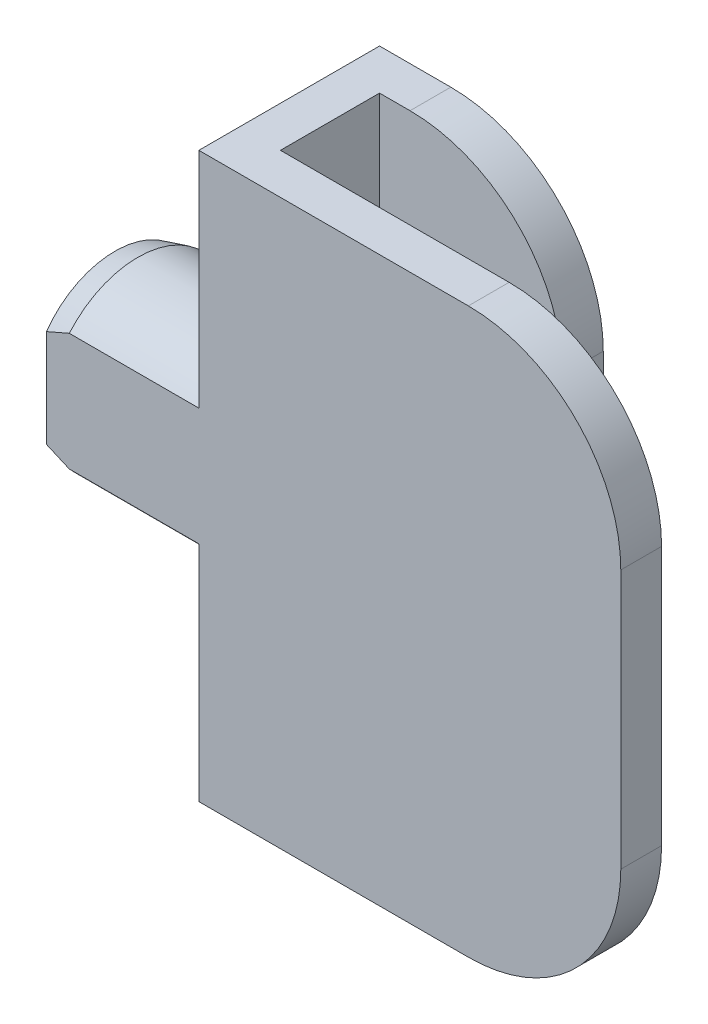
ISO-10303-21;
HEADER;
FILE_DESCRIPTION(('STEP AP214'),'2;1');
FILE_NAME('part.step','',(''),(''),'','','');
FILE_SCHEMA(('AUTOMOTIVE_DESIGN { 1 0 10303 214 1 1 1 1 }'));
ENDSEC;
DATA;
#1=APPLICATION_CONTEXT('core data for automotive mechanical design processes');
#2=APPLICATION_PROTOCOL_DEFINITION('international standard','automotive_design',2000,#1);
#3=PRODUCT_CONTEXT('',#1,'mechanical');
#4=PRODUCT('Part','Part','',(#3));
#5=PRODUCT_RELATED_PRODUCT_CATEGORY('part','',(#4));
#6=PRODUCT_DEFINITION_FORMATION('','',#4);
#7=PRODUCT_DEFINITION_CONTEXT('part definition',#1,'design');
#8=PRODUCT_DEFINITION('design','',#6,#7);
#9=PRODUCT_DEFINITION_SHAPE('','',#8);
#10=(LENGTH_UNIT() NAMED_UNIT(*) SI_UNIT(.MILLI.,.METRE.));
#11=(NAMED_UNIT(*) PLANE_ANGLE_UNIT() SI_UNIT($,.RADIAN.));
#12=(NAMED_UNIT(*) SI_UNIT($,.STERADIAN.) SOLID_ANGLE_UNIT());
#13=UNCERTAINTY_MEASURE_WITH_UNIT(LENGTH_MEASURE(1.E-05),#10,'distance_accuracy_value','');
#14=(GEOMETRIC_REPRESENTATION_CONTEXT(3) GLOBAL_UNCERTAINTY_ASSIGNED_CONTEXT((#13)) GLOBAL_UNIT_ASSIGNED_CONTEXT((#10,
#11,#12)) REPRESENTATION_CONTEXT('',''));
#15=CARTESIAN_POINT('',(0.,0.,0.));
#16=DIRECTION('',(0.,0.,1.));
#17=DIRECTION('',(1.,0.,0.));
#18=AXIS2_PLACEMENT_3D('',#15,#16,#17);
#19=CARTESIAN_POINT('',(0.,-18.5,0.));
#20=DIRECTION('',(0.,1.,0.));
#21=DIRECTION('',(0.,0.,1.));
#22=AXIS2_PLACEMENT_3D('',#19,#20,#21);
#23=PLANE('',#22);
#24=DIRECTION('',(0.,0.,-1.));
#25=VECTOR('',#24,1.);
#26=CARTESIAN_POINT('',(3.49999999999999,-18.5,5.92600000000001));
#27=LINE('',#26,#25);
#28=CARTESIAN_POINT('',(3.49999999999999,-18.5,-5.06746553720356));
#29=VERTEX_POINT('',#28);
#30=CARTESIAN_POINT('',(3.49999999999999,-18.5,-5.92500000000001));
#31=VERTEX_POINT('',#30);
#32=EDGE_CURVE('E276',#29,#31,#27,.T.);
#33=ORIENTED_EDGE('',*,*,#32,.F.);
#34=CARTESIAN_POINT('',(4.0907670429884,-18.5,-15.05));
#35=DIRECTION('',(0.,1.,0.));
#36=DIRECTION('',(0.,0.,1.));
#37=AXIS2_PLACEMENT_3D('',#34,#35,#36);
#38=CIRCLE('',#37,10.);
#39=CARTESIAN_POINT('',(0.,-18.5,-5.92500000000001));
#40=VERTEX_POINT('',#39);
#41=EDGE_CURVE('E204',#29,#40,#38,.F.);
#42=ORIENTED_EDGE('',*,*,#41,.T.);
#43=DIRECTION('',(-1.,0.,0.));
#44=VECTOR('',#43,1.);
#45=CARTESIAN_POINT('',(12.,-18.5,-5.92500000000001));
#46=LINE('',#45,#44);
#47=EDGE_CURVE('E213',#31,#40,#46,.T.);
#48=ORIENTED_EDGE('',*,*,#47,.F.);
#49=EDGE_LOOP('',(#33,#42,#48));
#50=FACE_BOUND('',#49,.T.);
#51=ADVANCED_FACE('F34',(#50),#23,.F.);
#52=CARTESIAN_POINT('',(0.,0.,-5.05));
#53=DIRECTION('',(0.,0.,1.));
#54=DIRECTION('',(1.,0.,0.));
#55=AXIS2_PLACEMENT_3D('',#52,#53,#54);
#56=PLANE('',#55);
#57=DIRECTION('',(1.,0.,0.));
#58=VECTOR('',#57,1.);
#59=CARTESIAN_POINT('',(-2.67500000000001,-20.,-5.05));
#60=LINE('',#59,#58);
#61=CARTESIAN_POINT('',(4.0907670429884,-20.,-5.05));
#62=VERTEX_POINT('',#61);
#63=CARTESIAN_POINT('',(12.,-20.,-5.05));
#64=VERTEX_POINT('',#63);
#65=EDGE_CURVE('E237',#62,#64,#60,.T.);
#66=ORIENTED_EDGE('',*,*,#65,.F.);
#67=DIRECTION('',(0.,1.,0.));
#68=VECTOR('',#67,1.);
#69=CARTESIAN_POINT('',(4.0907670429884,0.,-5.05));
#70=LINE('',#69,#68);
#71=CARTESIAN_POINT('',(4.0907670429884,-18.5,-5.05));
#72=VERTEX_POINT('',#71);
#73=EDGE_CURVE('E199',#62,#72,#70,.T.);
#74=ORIENTED_EDGE('',*,*,#73,.T.);
#75=DIRECTION('',(-1.,0.,0.));
#76=VECTOR('',#75,1.);
#77=CARTESIAN_POINT('',(-2.67500000000001,-18.5,-5.05));
#78=LINE('',#77,#76);
#79=CARTESIAN_POINT('',(12.,-18.5,-5.05));
#80=VERTEX_POINT('',#79);
#81=EDGE_CURVE('E243',#80,#72,#78,.T.);
#82=ORIENTED_EDGE('',*,*,#81,.F.);
#83=DIRECTION('',(0.,1.,0.));
#84=VECTOR('',#83,1.);
#85=CARTESIAN_POINT('',(12.,-18.5,-5.05));
#86=LINE('',#85,#84);
#87=EDGE_CURVE('E239',#64,#80,#86,.T.);
#88=ORIENTED_EDGE('',*,*,#87,.F.);
#89=EDGE_LOOP('',(#66,#74,#82,#88));
#90=FACE_BOUND('',#89,.T.);
#91=ADVANCED_FACE('F379',(#90),#56,.F.);
#92=DIRECTION('',(-1.,0.,0.));
#93=VECTOR('',#92,1.);
#94=CARTESIAN_POINT('',(0.,-18.5,3.25));
#95=LINE('',#94,#93);
#96=CARTESIAN_POINT('',(15.,-18.5,3.25));
#97=VERTEX_POINT('',#96);
#98=CARTESIAN_POINT('',(0.,-18.5,3.25));
#99=VERTEX_POINT('',#98);
#100=EDGE_CURVE('E313',#97,#99,#95,.T.);
#101=ORIENTED_EDGE('',*,*,#100,.F.);
#102=DIRECTION('',(0.,0.,-1.));
#103=VECTOR('',#102,1.);
#104=CARTESIAN_POINT('',(15.,-18.5,0.));
#105=LINE('',#104,#103);
#106=CARTESIAN_POINT('',(15.,-18.5,5.925));
#107=VERTEX_POINT('',#106);
#108=EDGE_CURVE('E432',#97,#107,#105,.F.);
#109=ORIENTED_EDGE('',*,*,#108,.T.);
#110=DIRECTION('',(1.,0.,0.));
#111=VECTOR('',#110,1.);
#112=CARTESIAN_POINT('',(-2.675,-18.5,5.92500000000001));
#113=LINE('',#112,#111);
#114=CARTESIAN_POINT('',(-2.675,-18.5,5.92500000000001));
#115=VERTEX_POINT('',#114);
#116=EDGE_CURVE('E310',#115,#107,#113,.T.);
#117=ORIENTED_EDGE('',*,*,#116,.F.);
#118=DIRECTION('',(0.,0.,1.));
#119=VECTOR('',#118,1.);
#120=CARTESIAN_POINT('',(-2.67500000000001,-18.5,-5.92500000000001));
#121=LINE('',#120,#119);
#122=CARTESIAN_POINT('',(-2.67500000000001,-18.5,-1.75));
#123=VERTEX_POINT('',#122);
#124=EDGE_CURVE('E308',#123,#115,#121,.T.);
#125=ORIENTED_EDGE('',*,*,#124,.F.);
#126=DIRECTION('',(-1.,0.,0.));
#127=VECTOR('',#126,1.);
#128=CARTESIAN_POINT('',(0.,-18.5,-1.75));
#129=LINE('',#128,#127);
#130=CARTESIAN_POINT('',(0.,-18.5,-1.75));
#131=VERTEX_POINT('',#130);
#132=EDGE_CURVE('E467',#123,#131,#129,.F.);
#133=ORIENTED_EDGE('',*,*,#132,.T.);
#134=DIRECTION('',(0.,0.,-1.));
#135=VECTOR('',#134,1.);
#136=CARTESIAN_POINT('',(0.,-18.5,-3.25));
#137=LINE('',#136,#135);
#138=EDGE_CURVE('E294',#99,#131,#137,.T.);
#139=ORIENTED_EDGE('',*,*,#138,.F.);
#140=EDGE_LOOP('',(#101,#109,#117,#125,#133,#139));
#141=FACE_BOUND('',#140,.T.);
#142=ADVANCED_FACE('F375',(#141),#23,.F.);
#143=CARTESIAN_POINT('',(12.,18.5,-3.25));
#144=DIRECTION('',(-1.,0.,0.));
#145=DIRECTION('',(0.,0.,1.));
#146=AXIS2_PLACEMENT_3D('',#143,#144,#145);
#147=PLANE('',#146);
#148=DIRECTION('',(0.,-1.,0.));
#149=VECTOR('',#148,1.);
#150=CARTESIAN_POINT('',(12.,18.5,-5.92500000000001));
#151=LINE('',#150,#149);
#152=CARTESIAN_POINT('',(12.,8.5,-5.92500000000001));
#153=VERTEX_POINT('',#152);
#154=CARTESIAN_POINT('',(12.,-17.35,-5.92500000000001));
#155=VERTEX_POINT('',#154);
#156=EDGE_CURVE('E335',#153,#155,#151,.T.);
#157=ORIENTED_EDGE('',*,*,#156,.F.);
#158=DIRECTION('',(0.,0.,-1.));
#159=VECTOR('',#158,1.);
#160=CARTESIAN_POINT('',(12.,8.5,-3.25));
#161=LINE('',#160,#159);
#162=CARTESIAN_POINT('',(12.,8.5,-3.25));
#163=VERTEX_POINT('',#162);
#164=EDGE_CURVE('E42',#153,#163,#161,.F.);
#165=ORIENTED_EDGE('',*,*,#164,.T.);
#166=DIRECTION('',(0.,-1.,0.));
#167=VECTOR('',#166,1.);
#168=CARTESIAN_POINT('',(12.,18.5,-3.25));
#169=LINE('',#168,#167);
#170=CARTESIAN_POINT('',(12.,-17.35,-3.25));
#171=VERTEX_POINT('',#170);
#172=EDGE_CURVE('E306',#163,#171,#169,.T.);
#173=ORIENTED_EDGE('',*,*,#172,.T.);
#174=DIRECTION('',(0.,0.,-1.));
#175=VECTOR('',#174,1.);
#176=CARTESIAN_POINT('',(12.,-17.35,5.92600000000001));
#177=LINE('',#176,#175);
#178=EDGE_CURVE('E273',#171,#155,#177,.T.);
#179=ORIENTED_EDGE('',*,*,#178,.T.);
#180=EDGE_LOOP('',(#157,#165,#173,#179));
#181=FACE_BOUND('',#180,.T.);
#182=ADVANCED_FACE('F373',(#181),#147,.F.);
#183=CARTESIAN_POINT('',(12.,18.5,-5.92500000000001));
#184=DIRECTION('',(0.,0.,1.));
#185=DIRECTION('',(1.,0.,0.));
#186=AXIS2_PLACEMENT_3D('',#183,#184,#185);
#187=PLANE('',#186);
#188=DIRECTION('',(-1.,0.,0.));
#189=VECTOR('',#188,1.);
#190=CARTESIAN_POINT('',(12.,18.5,-5.92500000000001));
#191=LINE('',#190,#189);
#192=CARTESIAN_POINT('',(2.,18.5,-5.92500000000001));
#193=VERTEX_POINT('',#192);
#194=CARTESIAN_POINT('',(-2.67500000000001,18.5,-5.92500000000001));
#195=VERTEX_POINT('',#194);
#196=EDGE_CURVE('E291',#193,#195,#191,.T.);
#197=ORIENTED_EDGE('',*,*,#196,.F.);
#198=CARTESIAN_POINT('',(2.,8.5,-5.92500000000001));
#199=DIRECTION('',(0.,0.,1.));
#200=DIRECTION('',(1.,0.,0.));
#201=AXIS2_PLACEMENT_3D('',#198,#199,#200);
#202=CIRCLE('',#201,10.);
#203=EDGE_CURVE('E56',#193,#153,#202,.F.);
#204=ORIENTED_EDGE('',*,*,#203,.T.);
#205=ORIENTED_EDGE('',*,*,#156,.T.);
#206=DIRECTION('',(1.,0.,0.));
#207=VECTOR('',#206,1.);
#208=CARTESIAN_POINT('',(0.,-17.35,-5.92500000000001));
#209=LINE('',#208,#207);
#210=CARTESIAN_POINT('',(3.49999999999999,-17.35,-5.92500000000001));
#211=VERTEX_POINT('',#210);
#212=EDGE_CURVE('E266',#211,#155,#209,.T.);
#213=ORIENTED_EDGE('',*,*,#212,.F.);
#214=DIRECTION('',(0.,1.,0.));
#215=VECTOR('',#214,1.);
#216=CARTESIAN_POINT('',(3.5,0.,-5.92500000000001));
#217=LINE('',#216,#215);
#218=EDGE_CURVE('E264',#31,#211,#217,.T.);
#219=ORIENTED_EDGE('',*,*,#218,.F.);
#220=ORIENTED_EDGE('',*,*,#47,.T.);
#221=DIRECTION('',(0.,1.,0.));
#222=VECTOR('',#221,1.);
#223=CARTESIAN_POINT('',(0.,-20.,-5.92500000000001));
#224=LINE('',#223,#222);
#225=CARTESIAN_POINT('',(0.,-20.,-5.92500000000001));
#226=VERTEX_POINT('',#225);
#227=EDGE_CURVE('E198',#226,#40,#224,.T.);
#228=ORIENTED_EDGE('',*,*,#227,.F.);
#229=DIRECTION('',(1.,0.,0.));
#230=VECTOR('',#229,1.);
#231=CARTESIAN_POINT('',(-2.67500000000001,-20.,-5.92500000000001));
#232=LINE('',#231,#230);
#233=CARTESIAN_POINT('',(-2.67500000000001,-20.,-5.92500000000001));
#234=VERTEX_POINT('',#233);
#235=EDGE_CURVE('E210',#234,#226,#232,.T.);
#236=ORIENTED_EDGE('',*,*,#235,.F.);
#237=DIRECTION('',(0.,-1.,0.));
#238=VECTOR('',#237,1.);
#239=CARTESIAN_POINT('',(-2.67500000000001,18.5,-5.92500000000001));
#240=LINE('',#239,#238);
#241=EDGE_CURVE('E333',#195,#234,#240,.T.);
#242=ORIENTED_EDGE('',*,*,#241,.F.);
#243=EDGE_LOOP('',(#197,#204,#205,#213,#219,#220,#228,#236,#242));
#244=FACE_BOUND('',#243,.T.);
#245=ADVANCED_FACE('F208',(#244),#187,.F.);
#246=CARTESIAN_POINT('',(-2.67500000000001,18.5,-5.92500000000001));
#247=DIRECTION('',(1.,0.,0.));
#248=DIRECTION('',(0.,0.,-1.));
#249=AXIS2_PLACEMENT_3D('',#246,#247,#248);
#250=PLANE('',#249);
#251=CARTESIAN_POINT('',(-2.675,0.,1.425));
#252=DIRECTION('',(-1.,0.,0.));
#253=DIRECTION('',(0.,0.,1.));
#254=AXIS2_PLACEMENT_3D('',#251,#252,#253);
#255=CIRCLE('',#254,5.925);
#256=CARTESIAN_POINT('',(-2.675,3.85429954725888,5.92500000000001));
#257=VERTEX_POINT('',#256);
#258=CARTESIAN_POINT('',(-2.675,-3.85429954725888,5.92500000000001));
#259=VERTEX_POINT('',#258);
#260=EDGE_CURVE('E288',#257,#259,#255,.T.);
#261=ORIENTED_EDGE('',*,*,#260,.F.);
#262=DIRECTION('',(0.,-1.,0.));
#263=VECTOR('',#262,1.);
#264=CARTESIAN_POINT('',(-2.675,18.5,5.92500000000001));
#265=LINE('',#264,#263);
#266=CARTESIAN_POINT('',(-2.675,18.5,5.92500000000001));
#267=VERTEX_POINT('',#266);
#268=EDGE_CURVE('E330',#267,#257,#265,.T.);
#269=ORIENTED_EDGE('',*,*,#268,.F.);
#270=DIRECTION('',(0.,0.,1.));
#271=VECTOR('',#270,1.);
#272=CARTESIAN_POINT('',(-2.67500000000001,18.5,-5.92500000000001));
#273=LINE('',#272,#271);
#274=EDGE_CURVE('E293',#195,#267,#273,.T.);
#275=ORIENTED_EDGE('',*,*,#274,.F.);
#276=ORIENTED_EDGE('',*,*,#241,.T.);
#277=DIRECTION('',(0.,0.,1.));
#278=VECTOR('',#277,1.);
#279=CARTESIAN_POINT('',(-2.67500000000001,-20.,-5.05));
#280=LINE('',#279,#278);
#281=CARTESIAN_POINT('',(-2.67500000000001,-20.,-3.25));
#282=VERTEX_POINT('',#281);
#283=EDGE_CURVE('E220',#234,#282,#280,.T.);
#284=ORIENTED_EDGE('',*,*,#283,.T.);
#285=CARTESIAN_POINT('',(-2.67500000000001,-20.,-1.75));
#286=DIRECTION('',(1.,0.,0.));
#287=DIRECTION('',(0.,0.,-1.));
#288=AXIS2_PLACEMENT_3D('',#285,#286,#287);
#289=CIRCLE('',#288,1.5);
#290=EDGE_CURVE('E465',#282,#123,#289,.T.);
#291=ORIENTED_EDGE('',*,*,#290,.T.);
#292=ORIENTED_EDGE('',*,*,#124,.T.);
#293=EDGE_CURVE('E329',#259,#115,#265,.T.);
#294=ORIENTED_EDGE('',*,*,#293,.F.);
#295=EDGE_LOOP('',(#261,#269,#275,#276,#284,#291,#292,#294));
#296=FACE_BOUND('',#295,.T.);
#297=ADVANCED_FACE('F365',(#296),#250,.F.);
#298=CARTESIAN_POINT('',(-2.675,18.5,5.92500000000001));
#299=DIRECTION('',(0.,0.,-1.));
#300=DIRECTION('',(-1.,0.,0.));
#301=AXIS2_PLACEMENT_3D('',#298,#299,#300);
#302=PLANE('',#301);
#303=ORIENTED_EDGE('',*,*,#116,.T.);
#304=CARTESIAN_POINT('',(15.,-8.5,5.925));
#305=DIRECTION('',(0.,0.,-1.));
#306=DIRECTION('',(-1.,0.,0.));
#307=AXIS2_PLACEMENT_3D('',#304,#305,#306);
#308=CIRCLE('',#307,10.);
#309=CARTESIAN_POINT('',(25.,-8.5,5.925));
#310=VERTEX_POINT('',#309);
#311=EDGE_CURVE('E435',#107,#310,#308,.F.);
#312=ORIENTED_EDGE('',*,*,#311,.T.);
#313=DIRECTION('',(0.,-1.,0.));
#314=VECTOR('',#313,1.);
#315=CARTESIAN_POINT('',(25.,18.5,5.925));
#316=LINE('',#315,#314);
#317=CARTESIAN_POINT('',(25.,8.5,5.925));
#318=VERTEX_POINT('',#317);
#319=EDGE_CURVE('E326',#318,#310,#316,.T.);
#320=ORIENTED_EDGE('',*,*,#319,.F.);
#321=CARTESIAN_POINT('',(15.,8.5,5.925));
#322=DIRECTION('',(0.,0.,-1.));
#323=DIRECTION('',(-1.,0.,0.));
#324=AXIS2_PLACEMENT_3D('',#321,#322,#323);
#325=CIRCLE('',#324,10.);
#326=CARTESIAN_POINT('',(15.,18.5,5.925));
#327=VERTEX_POINT('',#326);
#328=EDGE_CURVE('E424',#318,#327,#325,.F.);
#329=ORIENTED_EDGE('',*,*,#328,.T.);
#330=DIRECTION('',(1.,0.,0.));
#331=VECTOR('',#330,1.);
#332=CARTESIAN_POINT('',(-2.675,18.5,5.92500000000001));
#333=LINE('',#332,#331);
#334=EDGE_CURVE('E296',#267,#327,#333,.T.);
#335=ORIENTED_EDGE('',*,*,#334,.F.);
#336=ORIENTED_EDGE('',*,*,#268,.T.);
#337=DIRECTION('',(1.,0.,0.));
#338=VECTOR('',#337,1.);
#339=CARTESIAN_POINT('',(-12.675,3.85429954725888,5.92500000000001));
#340=LINE('',#339,#338);
#341=CARTESIAN_POINT('',(-11.175,3.85429954725888,5.92500000000001));
#342=VERTEX_POINT('',#341);
#343=EDGE_CURVE('E286',#342,#257,#340,.T.);
#344=ORIENTED_EDGE('',*,*,#343,.F.);
#345=CARTESIAN_POINT('',(-11.175,3.85429954725888,5.92500000000001));
#346=CARTESIAN_POINT('',(-11.3010400937942,3.80237887448433,5.92500000000001));
#347=CARTESIAN_POINT('',(-11.4268713576853,3.74994774245007,5.92500000000001));
#348=CARTESIAN_POINT('',(-11.6780312882562,3.64393383357036,5.92500000000001));
#349=CARTESIAN_POINT('',(-11.8033600085686,3.59035118372014,5.92500000000001));
#350=CARTESIAN_POINT('',(-12.0534594224424,3.48189139079883,5.92500000000001));
#351=CARTESIAN_POINT('',(-12.1782301078681,3.42701422892757,5.92500000000001));
#352=CARTESIAN_POINT('',(-12.4271267589311,3.31578155759638,5.92500000000001));
#353=CARTESIAN_POINT('',(-12.551252652254,3.25942588643216,5.92500000000001));
#354=CARTESIAN_POINT('',(-12.675,3.20224465592762,5.92500000000001));
#355=B_SPLINE_CURVE_WITH_KNOTS('',3,(#345,#346,#347,#348,#349,#350,#351,#352,#353,#354),
.UNSPECIFIED.,.F.,.F.,(4,2,2,2,4),(0.,0.408946692042037,0.817848512501498,1.22675627509564,
1.63570894784325),.UNSPECIFIED.);
#356=CARTESIAN_POINT('',(-12.675,3.20224465592762,5.92500000000001));
#357=VERTEX_POINT('',#356);
#358=EDGE_CURVE('E340',#342,#357,#355,.T.);
#359=ORIENTED_EDGE('',*,*,#358,.T.);
#360=DIRECTION('',(0.,-1.,0.));
#361=VECTOR('',#360,1.);
#362=CARTESIAN_POINT('',(-12.675,0.,5.92500000000001));
#363=LINE('',#362,#361);
#364=CARTESIAN_POINT('',(-12.675,-3.20224465592762,5.92500000000001));
#365=VERTEX_POINT('',#364);
#366=EDGE_CURVE('E280',#357,#365,#363,.T.);
#367=ORIENTED_EDGE('',*,*,#366,.T.);
#368=CARTESIAN_POINT('',(-12.675,-3.20224465592762,5.92500000000001));
#369=CARTESIAN_POINT('',(-12.551252652254,-3.25942588643216,5.92500000000001));
#370=CARTESIAN_POINT('',(-12.4271267589311,-3.31578155759638,5.92500000000001));
#371=CARTESIAN_POINT('',(-12.1782301078681,-3.42701422892757,5.92500000000001));
#372=CARTESIAN_POINT('',(-12.0534594224424,-3.48189139079883,5.92500000000001));
#373=CARTESIAN_POINT('',(-11.8033600085686,-3.59035118372014,5.92500000000001));
#374=CARTESIAN_POINT('',(-11.6780312882562,-3.64393383357036,5.92500000000001));
#375=CARTESIAN_POINT('',(-11.4268713576853,-3.74994774245007,5.92500000000001));
#376=CARTESIAN_POINT('',(-11.3010400937942,-3.80237887448433,5.92500000000001));
#377=CARTESIAN_POINT('',(-11.175,-3.85429954725888,5.92500000000001));
#378=B_SPLINE_CURVE_WITH_KNOTS('',3,(#368,#369,#370,#371,#372,#373,#374,#375,#376,#377),
.UNSPECIFIED.,.F.,.F.,(4,2,2,2,4),(0.,0.408952672747612,0.817860435341755,1.22676225580122,
1.63570894784325),.UNSPECIFIED.);
#379=CARTESIAN_POINT('',(-11.175,-3.85429954725888,5.92500000000001));
#380=VERTEX_POINT('',#379);
#381=EDGE_CURVE('E348',#365,#380,#378,.T.);
#382=ORIENTED_EDGE('',*,*,#381,.T.);
#383=DIRECTION('',(1.,0.,0.));
#384=VECTOR('',#383,1.);
#385=CARTESIAN_POINT('',(-12.675,-3.85429954725888,5.92500000000001));
#386=LINE('',#385,#384);
#387=EDGE_CURVE('E283',#259,#380,#386,.F.);
#388=ORIENTED_EDGE('',*,*,#387,.F.);
#389=ORIENTED_EDGE('',*,*,#293,.T.);
#390=EDGE_LOOP('',(#303,#312,#320,#329,#335,#336,#344,#359,#367,#382,#388,#389));
#391=FACE_BOUND('',#390,.T.);
#392=ADVANCED_FACE('F359',(#391),#302,.F.);
#393=CARTESIAN_POINT('',(25.,18.5,3.25));
#394=DIRECTION('',(-1.,0.,0.));
#395=DIRECTION('',(0.,0.,1.));
#396=AXIS2_PLACEMENT_3D('',#393,#394,#395);
#397=PLANE('',#396);
#398=ORIENTED_EDGE('',*,*,#319,.T.);
#399=DIRECTION('',(0.,0.,-1.));
#400=VECTOR('',#399,1.);
#401=CARTESIAN_POINT('',(25.,-8.5,3.25));
#402=LINE('',#401,#400);
#403=CARTESIAN_POINT('',(25.,-8.5,3.25));
#404=VERTEX_POINT('',#403);
#405=EDGE_CURVE('E418',#310,#404,#402,.T.);
#406=ORIENTED_EDGE('',*,*,#405,.T.);
#407=DIRECTION('',(0.,-1.,0.));
#408=VECTOR('',#407,1.);
#409=CARTESIAN_POINT('',(25.,18.5,3.25));
#410=LINE('',#409,#408);
#411=CARTESIAN_POINT('',(25.,8.5,3.25));
#412=VERTEX_POINT('',#411);
#413=EDGE_CURVE('E323',#412,#404,#410,.T.);
#414=ORIENTED_EDGE('',*,*,#413,.F.);
#415=DIRECTION('',(0.,0.,-1.));
#416=VECTOR('',#415,1.);
#417=CARTESIAN_POINT('',(25.,8.5,5.925));
#418=LINE('',#417,#416);
#419=EDGE_CURVE('E415',#412,#318,#418,.F.);
#420=ORIENTED_EDGE('',*,*,#419,.T.);
#421=EDGE_LOOP('',(#398,#406,#414,#420));
#422=FACE_BOUND('',#421,.T.);
#423=ADVANCED_FACE('F364',(#422),#397,.F.);
#424=CARTESIAN_POINT('',(0.,18.5,3.25));
#425=DIRECTION('',(0.,0.,1.));
#426=DIRECTION('',(1.,0.,0.));
#427=AXIS2_PLACEMENT_3D('',#424,#425,#426);
#428=PLANE('',#427);
#429=ORIENTED_EDGE('',*,*,#413,.T.);
#430=CARTESIAN_POINT('',(15.,-8.5,3.25));
#431=DIRECTION('',(0.,0.,1.));
#432=DIRECTION('',(1.,0.,0.));
#433=AXIS2_PLACEMENT_3D('',#430,#431,#432);
#434=CIRCLE('',#433,10.);
#435=EDGE_CURVE('E409',#404,#97,#434,.F.);
#436=ORIENTED_EDGE('',*,*,#435,.T.);
#437=ORIENTED_EDGE('',*,*,#100,.T.);
#438=DIRECTION('',(0.,-1.,0.));
#439=VECTOR('',#438,1.);
#440=CARTESIAN_POINT('',(0.,18.5,3.25));
#441=LINE('',#440,#439);
#442=CARTESIAN_POINT('',(0.,18.5,3.25));
#443=VERTEX_POINT('',#442);
#444=EDGE_CURVE('E320',#443,#99,#441,.T.);
#445=ORIENTED_EDGE('',*,*,#444,.F.);
#446=DIRECTION('',(-1.,0.,0.));
#447=VECTOR('',#446,1.);
#448=CARTESIAN_POINT('',(0.,18.5,3.25));
#449=LINE('',#448,#447);
#450=CARTESIAN_POINT('',(15.,18.5,3.25));
#451=VERTEX_POINT('',#450);
#452=EDGE_CURVE('E299',#451,#443,#449,.T.);
#453=ORIENTED_EDGE('',*,*,#452,.F.);
#454=CARTESIAN_POINT('',(15.,8.5,3.25));
#455=DIRECTION('',(0.,0.,1.));
#456=DIRECTION('',(1.,0.,0.));
#457=AXIS2_PLACEMENT_3D('',#454,#455,#456);
#458=CIRCLE('',#457,10.);
#459=EDGE_CURVE('E412',#451,#412,#458,.F.);
#460=ORIENTED_EDGE('',*,*,#459,.T.);
#461=EDGE_LOOP('',(#429,#436,#437,#445,#453,#460));
#462=FACE_BOUND('',#461,.T.);
#463=ADVANCED_FACE('F400',(#462),#428,.F.);
#464=CARTESIAN_POINT('',(0.,18.5,-3.25));
#465=DIRECTION('',(-1.,0.,0.));
#466=DIRECTION('',(0.,0.,1.));
#467=AXIS2_PLACEMENT_3D('',#464,#465,#466);
#468=PLANE('',#467);
#469=ORIENTED_EDGE('',*,*,#138,.T.);
#470=CARTESIAN_POINT('',(0.,-20.,-1.75));
#471=DIRECTION('',(-1.,0.,0.));
#472=DIRECTION('',(0.,0.,1.));
#473=AXIS2_PLACEMENT_3D('',#470,#471,#472);
#474=CIRCLE('',#473,1.5);
#475=CARTESIAN_POINT('',(0.,-20.,-3.25));
#476=VERTEX_POINT('',#475);
#477=EDGE_CURVE('E461',#131,#476,#474,.T.);
#478=ORIENTED_EDGE('',*,*,#477,.T.);
#479=DIRECTION('',(0.,-1.,0.));
#480=VECTOR('',#479,1.);
#481=CARTESIAN_POINT('',(0.,18.5,-3.25));
#482=LINE('',#481,#480);
#483=CARTESIAN_POINT('',(0.,18.5,-3.25));
#484=VERTEX_POINT('',#483);
#485=EDGE_CURVE('E318',#484,#476,#482,.T.);
#486=ORIENTED_EDGE('',*,*,#485,.F.);
#487=DIRECTION('',(0.,0.,-1.));
#488=VECTOR('',#487,1.);
#489=CARTESIAN_POINT('',(0.,18.5,-3.25));
#490=LINE('',#489,#488);
#491=EDGE_CURVE('E301',#443,#484,#490,.T.);
#492=ORIENTED_EDGE('',*,*,#491,.F.);
#493=ORIENTED_EDGE('',*,*,#444,.T.);
#494=EDGE_LOOP('',(#469,#478,#486,#492,#493));
#495=FACE_BOUND('',#494,.T.);
#496=ADVANCED_FACE('F397',(#495),#468,.F.);
#497=CARTESIAN_POINT('',(12.,18.5,-3.25));
#498=DIRECTION('',(0.,0.,-1.));
#499=DIRECTION('',(-1.,0.,0.));
#500=AXIS2_PLACEMENT_3D('',#497,#498,#499);
#501=PLANE('',#500);
#502=ORIENTED_EDGE('',*,*,#172,.F.);
#503=CARTESIAN_POINT('',(2.,8.5,-3.25));
#504=DIRECTION('',(0.,0.,-1.));
#505=DIRECTION('',(-1.,0.,0.));
#506=AXIS2_PLACEMENT_3D('',#503,#504,#505);
#507=CIRCLE('',#506,10.);
#508=CARTESIAN_POINT('',(2.,18.5,-3.25));
#509=VERTEX_POINT('',#508);
#510=EDGE_CURVE('E11',#163,#509,#507,.F.);
#511=ORIENTED_EDGE('',*,*,#510,.T.);
#512=DIRECTION('',(1.,0.,0.));
#513=VECTOR('',#512,1.);
#514=CARTESIAN_POINT('',(12.,18.5,-3.25));
#515=LINE('',#514,#513);
#516=EDGE_CURVE('E303',#484,#509,#515,.T.);
#517=ORIENTED_EDGE('',*,*,#516,.F.);
#518=ORIENTED_EDGE('',*,*,#485,.T.);
#519=DIRECTION('',(1.,0.,0.));
#520=VECTOR('',#519,1.);
#521=CARTESIAN_POINT('',(-2.67500000000001,-20.,-3.25));
#522=LINE('',#521,#520);
#523=CARTESIAN_POINT('',(12.,-20.,-3.25));
#524=VERTEX_POINT('',#523);
#525=EDGE_CURVE('E234',#476,#524,#522,.T.);
#526=ORIENTED_EDGE('',*,*,#525,.T.);
#527=DIRECTION('',(0.,1.,0.));
#528=VECTOR('',#527,1.);
#529=CARTESIAN_POINT('',(12.,-18.5,-3.25));
#530=LINE('',#529,#528);
#531=CARTESIAN_POINT('',(12.,-18.5,-3.25));
#532=VERTEX_POINT('',#531);
#533=EDGE_CURVE('E249',#524,#532,#530,.T.);
#534=ORIENTED_EDGE('',*,*,#533,.T.);
#535=DIRECTION('',(-1.,0.,0.));
#536=VECTOR('',#535,1.);
#537=CARTESIAN_POINT('',(-2.67500000000001,-18.5,-3.25));
#538=LINE('',#537,#536);
#539=CARTESIAN_POINT('',(3.49999999999999,-18.5,-3.25));
#540=VERTEX_POINT('',#539);
#541=EDGE_CURVE('E240',#532,#540,#538,.T.);
#542=ORIENTED_EDGE('',*,*,#541,.T.);
#543=DIRECTION('',(0.,-1.,0.));
#544=VECTOR('',#543,1.);
#545=CARTESIAN_POINT('',(3.5,0.,-3.25));
#546=LINE('',#545,#544);
#547=CARTESIAN_POINT('',(3.49999999999999,-17.35,-3.25));
#548=VERTEX_POINT('',#547);
#549=EDGE_CURVE('E261',#548,#540,#546,.T.);
#550=ORIENTED_EDGE('',*,*,#549,.F.);
#551=DIRECTION('',(-1.,0.,0.));
#552=VECTOR('',#551,1.);
#553=CARTESIAN_POINT('',(0.,-17.35,-3.25));
#554=LINE('',#553,#552);
#555=CARTESIAN_POINT('',(9.99999999999999,-17.35,-3.25));
#556=VERTEX_POINT('',#555);
#557=EDGE_CURVE('E256',#556,#548,#554,.T.);
#558=ORIENTED_EDGE('',*,*,#557,.F.);
#559=CARTESIAN_POINT('',(10.5,-17.35,-3.25));
#560=DIRECTION('',(0.,0.,1.));
#561=DIRECTION('',(-1.,0.,0.));
#562=AXIS2_PLACEMENT_3D('',#559,#560,#561);
#563=CIRCLE('',#562,0.5);
#564=CARTESIAN_POINT('',(11.,-17.35,-3.25));
#565=VERTEX_POINT('',#564);
#566=EDGE_CURVE('E214',#556,#565,#563,.T.);
#567=ORIENTED_EDGE('',*,*,#566,.T.);
#568=EDGE_CURVE('E265',#171,#565,#554,.T.);
#569=ORIENTED_EDGE('',*,*,#568,.F.);
#570=EDGE_LOOP('',(#502,#511,#517,#518,#526,#534,#542,#550,#558,#567,#569));
#571=FACE_BOUND('',#570,.T.);
#572=ADVANCED_FACE('F394',(#571),#501,.F.);
#573=CARTESIAN_POINT('',(0.,18.5,0.));
#574=DIRECTION('',(0.,1.,0.));
#575=DIRECTION('',(0.,0.,1.));
#576=AXIS2_PLACEMENT_3D('',#573,#574,#575);
#577=PLANE('',#576);
#578=ORIENTED_EDGE('',*,*,#334,.T.);
#579=DIRECTION('',(0.,0.,-1.));
#580=VECTOR('',#579,1.);
#581=CARTESIAN_POINT('',(15.,18.5,3.25));
#582=LINE('',#581,#580);
#583=EDGE_CURVE('E440',#327,#451,#582,.T.);
#584=ORIENTED_EDGE('',*,*,#583,.T.);
#585=ORIENTED_EDGE('',*,*,#452,.T.);
#586=ORIENTED_EDGE('',*,*,#491,.T.);
#587=ORIENTED_EDGE('',*,*,#516,.T.);
#588=DIRECTION('',(0.,0.,-1.));
#589=VECTOR('',#588,1.);
#590=CARTESIAN_POINT('',(2.,18.5,-5.92500000000001));
#591=LINE('',#590,#589);
#592=EDGE_CURVE('E437',#509,#193,#591,.T.);
#593=ORIENTED_EDGE('',*,*,#592,.T.);
#594=ORIENTED_EDGE('',*,*,#196,.T.);
#595=ORIENTED_EDGE('',*,*,#274,.T.);
#596=EDGE_LOOP('',(#578,#584,#585,#586,#587,#593,#594,#595));
#597=FACE_BOUND('',#596,.T.);
#598=ADVANCED_FACE('F392',(#597),#577,.T.);
#599=CARTESIAN_POINT('',(-12.675,0.,1.425));
#600=DIRECTION('',(1.,0.,0.));
#601=DIRECTION('',(0.,0.,-1.));
#602=AXIS2_PLACEMENT_3D('',#599,#600,#601);
#603=CYLINDRICAL_SURFACE('',#602,5.925);
#604=ORIENTED_EDGE('',*,*,#387,.T.);
#605=CARTESIAN_POINT('',(-11.175,0.,1.425));
#606=DIRECTION('',(-1.,0.,0.));
#607=DIRECTION('',(0.,0.,1.));
#608=AXIS2_PLACEMENT_3D('',#605,#606,#607);
#609=CIRCLE('',#608,5.925);
#610=EDGE_CURVE('E468',#380,#342,#609,.F.);
#611=ORIENTED_EDGE('',*,*,#610,.T.);
#612=ORIENTED_EDGE('',*,*,#343,.T.);
#613=ORIENTED_EDGE('',*,*,#260,.T.);
#614=EDGE_LOOP('',(#604,#611,#612,#613));
#615=FACE_BOUND('',#614,.T.);
#616=ADVANCED_FACE('F477',(#615),#603,.T.);
#617=CARTESIAN_POINT('',(-12.675,0.,1.425));
#618=DIRECTION('',(-1.,0.,0.));
#619=DIRECTION('',(0.,0.,1.));
#620=AXIS2_PLACEMENT_3D('',#617,#618,#619);
#621=PLANE('',#620);
#622=ORIENTED_EDGE('',*,*,#366,.F.);
#623=CARTESIAN_POINT('',(-12.675,0.,1.425));
#624=DIRECTION('',(-1.,0.,0.));
#625=DIRECTION('',(0.,0.,1.));
#626=AXIS2_PLACEMENT_3D('',#623,#624,#625);
#627=CIRCLE('',#626,5.52307621135333);
#628=EDGE_CURVE('E337',#357,#365,#627,.T.);
#629=ORIENTED_EDGE('',*,*,#628,.T.);
#630=EDGE_LOOP('',(#622,#629));
#631=FACE_BOUND('',#630,.T.);
#632=ADVANCED_FACE('F481',(#631),#621,.T.);
#633=CARTESIAN_POINT('',(-12.675,0.,1.425));
#634=DIRECTION('',(1.,0.,0.));
#635=DIRECTION('',(0.,0.,-1.));
#636=AXIS2_PLACEMENT_3D('',#633,#634,#635);
#637=CONICAL_SURFACE('',#636,5.52307621135333,0.261799387799146);
#638=ORIENTED_EDGE('',*,*,#358,.F.);
#639=ORIENTED_EDGE('',*,*,#610,.F.);
#640=ORIENTED_EDGE('',*,*,#381,.F.);
#641=ORIENTED_EDGE('',*,*,#628,.F.);
#642=EDGE_LOOP('',(#638,#639,#640,#641));
#643=FACE_BOUND('',#642,.T.);
#644=ADVANCED_FACE('F355',(#643),#637,.T.);
#645=CARTESIAN_POINT('',(3.5,0.,5.92600000000001));
#646=DIRECTION('',(-1.,0.,0.));
#647=DIRECTION('',(0.,-1.,0.));
#648=AXIS2_PLACEMENT_3D('',#645,#646,#647);
#649=PLANE('',#648);
#650=ORIENTED_EDGE('',*,*,#549,.T.);
#651=EDGE_CURVE('E278',#540,#29,#27,.T.);
#652=ORIENTED_EDGE('',*,*,#651,.T.);
#653=ORIENTED_EDGE('',*,*,#32,.T.);
#654=ORIENTED_EDGE('',*,*,#218,.T.);
#655=DIRECTION('',(0.,0.,-1.));
#656=VECTOR('',#655,1.);
#657=CARTESIAN_POINT('',(3.49999999999999,-17.35,5.92600000000001));
#658=LINE('',#657,#656);
#659=EDGE_CURVE('E269',#548,#211,#658,.T.);
#660=ORIENTED_EDGE('',*,*,#659,.F.);
#661=EDGE_LOOP('',(#650,#652,#653,#654,#660));
#662=FACE_BOUND('',#661,.T.);
#663=ADVANCED_FACE('F488',(#662),#649,.F.);
#664=CARTESIAN_POINT('',(0.,-17.35,5.92600000000001));
#665=DIRECTION('',(0.,1.,0.));
#666=DIRECTION('',(0.,0.,1.));
#667=AXIS2_PLACEMENT_3D('',#664,#665,#666);
#668=PLANE('',#667);
#669=DIRECTION('',(-1.,0.,0.));
#670=VECTOR('',#669,1.);
#671=CARTESIAN_POINT('',(11.,-17.35,-5.05));
#672=LINE('',#671,#670);
#673=CARTESIAN_POINT('',(11.,-17.35,-5.05));
#674=VERTEX_POINT('',#673);
#675=CARTESIAN_POINT('',(9.99999999999999,-17.35,-5.05));
#676=VERTEX_POINT('',#675);
#677=EDGE_CURVE('E226',#674,#676,#672,.T.);
#678=ORIENTED_EDGE('',*,*,#677,.T.);
#679=DIRECTION('',(0.,0.,1.));
#680=VECTOR('',#679,1.);
#681=CARTESIAN_POINT('',(9.99999999999999,-17.35,-5.05));
#682=LINE('',#681,#680);
#683=EDGE_CURVE('E231',#676,#556,#682,.T.);
#684=ORIENTED_EDGE('',*,*,#683,.T.);
#685=ORIENTED_EDGE('',*,*,#557,.T.);
#686=ORIENTED_EDGE('',*,*,#659,.T.);
#687=ORIENTED_EDGE('',*,*,#212,.T.);
#688=ORIENTED_EDGE('',*,*,#178,.F.);
#689=ORIENTED_EDGE('',*,*,#568,.T.);
#690=DIRECTION('',(0.,0.,1.));
#691=VECTOR('',#690,1.);
#692=CARTESIAN_POINT('',(11.,-17.35,-5.05));
#693=LINE('',#692,#691);
#694=EDGE_CURVE('E228',#674,#565,#693,.T.);
#695=ORIENTED_EDGE('',*,*,#694,.F.);
#696=EDGE_LOOP('',(#678,#684,#685,#686,#687,#688,#689,#695));
#697=FACE_BOUND('',#696,.T.);
#698=ADVANCED_FACE('F456',(#697),#668,.F.);
#699=CARTESIAN_POINT('',(-2.67500000000001,-18.5,-5.05));
#700=DIRECTION('',(0.,1.,0.));
#701=DIRECTION('',(0.,0.,1.));
#702=AXIS2_PLACEMENT_3D('',#699,#700,#701);
#703=PLANE('',#702);
#704=ORIENTED_EDGE('',*,*,#651,.F.);
#705=ORIENTED_EDGE('',*,*,#541,.F.);
#706=DIRECTION('',(0.,0.,1.));
#707=VECTOR('',#706,1.);
#708=CARTESIAN_POINT('',(12.,-18.5,-5.05));
#709=LINE('',#708,#707);
#710=EDGE_CURVE('E254',#80,#532,#709,.T.);
#711=ORIENTED_EDGE('',*,*,#710,.F.);
#712=ORIENTED_EDGE('',*,*,#81,.T.);
#713=CARTESIAN_POINT('',(4.0907670429884,-18.5,-15.05));
#714=DIRECTION('',(0.,1.,0.));
#715=DIRECTION('',(0.,0.,1.));
#716=AXIS2_PLACEMENT_3D('',#713,#714,#715);
#717=CIRCLE('',#716,10.);
#718=EDGE_CURVE('E203',#72,#29,#717,.F.);
#719=ORIENTED_EDGE('',*,*,#718,.T.);
#720=EDGE_LOOP('',(#704,#705,#711,#712,#719));
#721=FACE_BOUND('',#720,.T.);
#722=ADVANCED_FACE('F494',(#721),#703,.T.);
#723=CARTESIAN_POINT('',(12.,-18.5,-5.05));
#724=DIRECTION('',(1.,0.,0.));
#725=DIRECTION('',(0.,0.,-1.));
#726=AXIS2_PLACEMENT_3D('',#723,#724,#725);
#727=PLANE('',#726);
#728=ORIENTED_EDGE('',*,*,#533,.F.);
#729=DIRECTION('',(0.,0.,1.));
#730=VECTOR('',#729,1.);
#731=CARTESIAN_POINT('',(12.,-20.,-5.05));
#732=LINE('',#731,#730);
#733=EDGE_CURVE('E257',#64,#524,#732,.T.);
#734=ORIENTED_EDGE('',*,*,#733,.F.);
#735=ORIENTED_EDGE('',*,*,#87,.T.);
#736=ORIENTED_EDGE('',*,*,#710,.T.);
#737=EDGE_LOOP('',(#728,#734,#735,#736));
#738=FACE_BOUND('',#737,.T.);
#739=ADVANCED_FACE('F498',(#738),#727,.T.);
#740=CARTESIAN_POINT('',(-2.67500000000001,-20.,-5.05));
#741=DIRECTION('',(0.,-1.,0.));
#742=DIRECTION('',(0.,0.,-1.));
#743=AXIS2_PLACEMENT_3D('',#740,#741,#742);
#744=PLANE('',#743);
#745=EDGE_CURVE('E246',#282,#476,#522,.T.);
#746=ORIENTED_EDGE('',*,*,#745,.F.);
#747=ORIENTED_EDGE('',*,*,#283,.F.);
#748=ORIENTED_EDGE('',*,*,#235,.T.);
#749=CARTESIAN_POINT('',(4.0907670429884,-20.,-15.05));
#750=DIRECTION('',(0.,-1.,0.));
#751=DIRECTION('',(0.,0.,-1.));
#752=AXIS2_PLACEMENT_3D('',#749,#750,#751);
#753=CIRCLE('',#752,10.);
#754=EDGE_CURVE('E193',#226,#62,#753,.F.);
#755=ORIENTED_EDGE('',*,*,#754,.T.);
#756=ORIENTED_EDGE('',*,*,#65,.T.);
#757=ORIENTED_EDGE('',*,*,#733,.T.);
#758=ORIENTED_EDGE('',*,*,#525,.F.);
#759=EDGE_LOOP('',(#746,#747,#748,#755,#756,#757,#758));
#760=FACE_BOUND('',#759,.T.);
#761=ADVANCED_FACE('F218',(#760),#744,.T.);
#762=CARTESIAN_POINT('',(10.5,-17.35,-5.05));
#763=DIRECTION('',(0.,0.,1.));
#764=DIRECTION('',(1.,0.,0.));
#765=AXIS2_PLACEMENT_3D('',#762,#763,#764);
#766=CYLINDRICAL_SURFACE('',#765,0.5);
#767=ORIENTED_EDGE('',*,*,#566,.F.);
#768=ORIENTED_EDGE('',*,*,#683,.F.);
#769=CARTESIAN_POINT('',(10.5,-17.35,-5.05));
#770=DIRECTION('',(0.,0.,1.));
#771=DIRECTION('',(-1.,0.,0.));
#772=AXIS2_PLACEMENT_3D('',#769,#770,#771);
#773=CIRCLE('',#772,0.5);
#774=EDGE_CURVE('E223',#676,#674,#773,.T.);
#775=ORIENTED_EDGE('',*,*,#774,.T.);
#776=ORIENTED_EDGE('',*,*,#694,.T.);
#777=EDGE_LOOP('',(#767,#768,#775,#776));
#778=FACE_BOUND('',#777,.T.);
#779=ADVANCED_FACE('F497',(#778),#766,.T.);
#780=CARTESIAN_POINT('',(10.5,-17.35,-5.05));
#781=DIRECTION('',(0.,0.,-1.));
#782=DIRECTION('',(-1.,0.,0.));
#783=AXIS2_PLACEMENT_3D('',#780,#781,#782);
#784=PLANE('',#783);
#785=ORIENTED_EDGE('',*,*,#774,.F.);
#786=ORIENTED_EDGE('',*,*,#677,.F.);
#787=EDGE_LOOP('',(#785,#786));
#788=FACE_BOUND('',#787,.T.);
#789=ADVANCED_FACE('F507',(#788),#784,.T.);
#790=CARTESIAN_POINT('',(12.,-20.,-1.75));
#791=DIRECTION('',(1.,0.,0.));
#792=DIRECTION('',(0.,0.,-1.));
#793=AXIS2_PLACEMENT_3D('',#790,#791,#792);
#794=CYLINDRICAL_SURFACE('',#793,1.5);
#795=ORIENTED_EDGE('',*,*,#477,.F.);
#796=ORIENTED_EDGE('',*,*,#132,.F.);
#797=ORIENTED_EDGE('',*,*,#290,.F.);
#798=ORIENTED_EDGE('',*,*,#745,.T.);
#799=EDGE_LOOP('',(#795,#796,#797,#798));
#800=FACE_BOUND('',#799,.T.);
#801=ADVANCED_FACE('F510',(#800),#794,.F.);
#802=CARTESIAN_POINT('',(4.0907670429884,-20.,-15.05));
#803=DIRECTION('',(0.,1.,0.));
#804=DIRECTION('',(0.,0.,1.));
#805=AXIS2_PLACEMENT_3D('',#802,#803,#804);
#806=CYLINDRICAL_SURFACE('',#805,10.);
#807=ORIENTED_EDGE('',*,*,#718,.F.);
#808=ORIENTED_EDGE('',*,*,#73,.F.);
#809=ORIENTED_EDGE('',*,*,#754,.F.);
#810=ORIENTED_EDGE('',*,*,#227,.T.);
#811=ORIENTED_EDGE('',*,*,#41,.F.);
#812=EDGE_LOOP('',(#807,#808,#809,#810,#811));
#813=FACE_BOUND('',#812,.T.);
#814=ADVANCED_FACE('F196',(#813),#806,.F.);
#815=CARTESIAN_POINT('',(15.,-8.5,3.25));
#816=DIRECTION('',(0.,0.,-1.));
#817=DIRECTION('',(-1.,0.,0.));
#818=AXIS2_PLACEMENT_3D('',#815,#816,#817);
#819=CYLINDRICAL_SURFACE('',#818,10.);
#820=ORIENTED_EDGE('',*,*,#311,.F.);
#821=ORIENTED_EDGE('',*,*,#108,.F.);
#822=ORIENTED_EDGE('',*,*,#435,.F.);
#823=ORIENTED_EDGE('',*,*,#405,.F.);
#824=EDGE_LOOP('',(#820,#821,#822,#823));
#825=FACE_BOUND('',#824,.T.);
#826=ADVANCED_FACE('F534',(#825),#819,.T.);
#827=CARTESIAN_POINT('',(15.,8.5,0.));
#828=DIRECTION('',(0.,0.,1.));
#829=DIRECTION('',(1.,0.,0.));
#830=AXIS2_PLACEMENT_3D('',#827,#828,#829);
#831=CYLINDRICAL_SURFACE('',#830,10.);
#832=ORIENTED_EDGE('',*,*,#328,.F.);
#833=ORIENTED_EDGE('',*,*,#419,.F.);
#834=ORIENTED_EDGE('',*,*,#459,.F.);
#835=ORIENTED_EDGE('',*,*,#583,.F.);
#836=EDGE_LOOP('',(#832,#833,#834,#835));
#837=FACE_BOUND('',#836,.T.);
#838=ADVANCED_FACE('F421',(#837),#831,.T.);
#839=CARTESIAN_POINT('',(2.,8.5,0.));
#840=DIRECTION('',(0.,0.,1.));
#841=DIRECTION('',(1.,0.,0.));
#842=AXIS2_PLACEMENT_3D('',#839,#840,#841);
#843=CYLINDRICAL_SURFACE('',#842,10.);
#844=ORIENTED_EDGE('',*,*,#510,.F.);
#845=ORIENTED_EDGE('',*,*,#164,.F.);
#846=ORIENTED_EDGE('',*,*,#203,.F.);
#847=ORIENTED_EDGE('',*,*,#592,.F.);
#848=EDGE_LOOP('',(#844,#845,#846,#847));
#849=FACE_BOUND('',#848,.T.);
#850=ADVANCED_FACE('F36',(#849),#843,.T.);
#851=CLOSED_SHELL('',(#51,#91,#142,#182,#245,#297,#392,#423,#463,#496,#572,#598,#616,#632,#644,
#663,#698,#722,#739,#761,#779,#789,#801,#814,#826,#838,#850));
#852=MANIFOLD_SOLID_BREP('B2',#851);
#853=ADVANCED_BREP_SHAPE_REPRESENTATION('',(#18,#852),#14);
#854=SHAPE_DEFINITION_REPRESENTATION(#9,#853);
ENDSEC;
END-ISO-10303-21;
